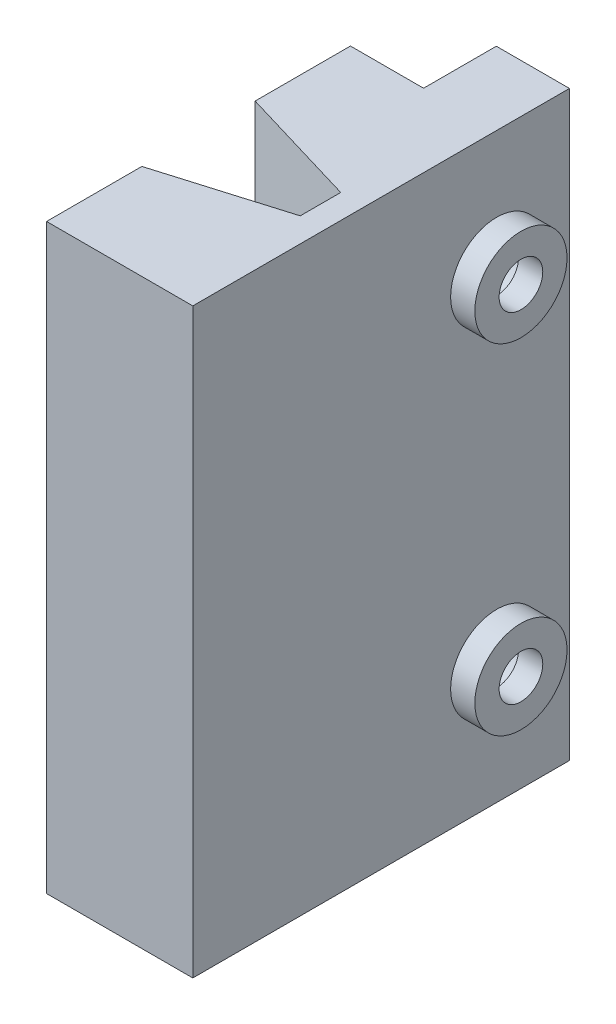
ISO-10303-21;
HEADER;
FILE_DESCRIPTION(('STEP AP214'),'2;1');
FILE_NAME('part.step','',(''),(''),'','','');
FILE_SCHEMA(('AUTOMOTIVE_DESIGN { 1 0 10303 214 1 1 1 1 }'));
ENDSEC;
DATA;
#1=APPLICATION_CONTEXT('core data for automotive mechanical design processes');
#2=APPLICATION_PROTOCOL_DEFINITION('international standard','automotive_design',2000,#1);
#3=PRODUCT_CONTEXT('',#1,'mechanical');
#4=PRODUCT('Part','Part','',(#3));
#5=PRODUCT_RELATED_PRODUCT_CATEGORY('part','',(#4));
#6=PRODUCT_DEFINITION_FORMATION('','',#4);
#7=PRODUCT_DEFINITION_CONTEXT('part definition',#1,'design');
#8=PRODUCT_DEFINITION('design','',#6,#7);
#9=PRODUCT_DEFINITION_SHAPE('','',#8);
#10=(LENGTH_UNIT() NAMED_UNIT(*) SI_UNIT(.MILLI.,.METRE.));
#11=(NAMED_UNIT(*) PLANE_ANGLE_UNIT() SI_UNIT($,.RADIAN.));
#12=(NAMED_UNIT(*) SI_UNIT($,.STERADIAN.) SOLID_ANGLE_UNIT());
#13=UNCERTAINTY_MEASURE_WITH_UNIT(LENGTH_MEASURE(1.E-05),#10,'distance_accuracy_value','');
#14=(GEOMETRIC_REPRESENTATION_CONTEXT(3) GLOBAL_UNCERTAINTY_ASSIGNED_CONTEXT((#13)) GLOBAL_UNIT_ASSIGNED_CONTEXT((#10,
#11,#12)) REPRESENTATION_CONTEXT('',''));
#15=CARTESIAN_POINT('',(0.,0.,0.));
#16=DIRECTION('',(0.,0.,1.));
#17=DIRECTION('',(1.,0.,0.));
#18=AXIS2_PLACEMENT_3D('',#15,#16,#17);
#19=CARTESIAN_POINT('',(-1.03,24.,1.785));
#20=DIRECTION('',(1.,0.,0.));
#21=DIRECTION('',(0.,0.,-1.));
#22=AXIS2_PLACEMENT_3D('',#19,#20,#21);
#23=PLANE('',#22);
#24=DIRECTION('',(0.,1.,0.));
#25=VECTOR('',#24,1.);
#26=CARTESIAN_POINT('',(-1.03,-6.,3.285));
#27=LINE('',#26,#25);
#28=CARTESIAN_POINT('',(-1.03,0.,3.285));
#29=VERTEX_POINT('',#28);
#30=CARTESIAN_POINT('',(-1.03,24.,3.285));
#31=VERTEX_POINT('',#30);
#32=EDGE_CURVE('E150',#29,#31,#27,.T.);
#33=ORIENTED_EDGE('',*,*,#32,.F.);
#34=DIRECTION('',(0.,0.,1.));
#35=VECTOR('',#34,1.);
#36=CARTESIAN_POINT('',(-1.03,0.,1.785));
#37=LINE('',#36,#35);
#38=CARTESIAN_POINT('',(-1.03,0.,7.215));
#39=VERTEX_POINT('',#38);
#40=EDGE_CURVE('E172',#29,#39,#37,.T.);
#41=ORIENTED_EDGE('',*,*,#40,.T.);
#42=DIRECTION('',(0.,-1.,0.));
#43=VECTOR('',#42,1.);
#44=CARTESIAN_POINT('',(-1.03,24.,7.215));
#45=LINE('',#44,#43);
#46=CARTESIAN_POINT('',(-1.03,24.,7.215));
#47=VERTEX_POINT('',#46);
#48=EDGE_CURVE('E155',#47,#39,#45,.T.);
#49=ORIENTED_EDGE('',*,*,#48,.F.);
#50=DIRECTION('',(0.,0.,1.));
#51=VECTOR('',#50,1.);
#52=CARTESIAN_POINT('',(-1.03,24.,1.785));
#53=LINE('',#52,#51);
#54=EDGE_CURVE('E153',#31,#47,#53,.T.);
#55=ORIENTED_EDGE('',*,*,#54,.F.);
#56=EDGE_LOOP('',(#33,#41,#49,#55));
#57=FACE_BOUND('',#56,.T.);
#58=ADVANCED_FACE('F32',(#57),#23,.F.);
#59=CARTESIAN_POINT('',(0.,24.,0.));
#60=DIRECTION('',(0.,1.,0.));
#61=DIRECTION('',(0.,0.,1.));
#62=AXIS2_PLACEMENT_3D('',#59,#60,#61);
#63=PLANE('',#62);
#64=DIRECTION('',(-0.958296914540683,0.,-0.285774427795432));
#65=VECTOR('',#64,1.);
#66=CARTESIAN_POINT('',(0.295174567799963,24.,-0.989818717355876));
#67=LINE('',#66,#65);
#68=CARTESIAN_POINT('',(4.,24.,0.115));
#69=VERTEX_POINT('',#68);
#70=CARTESIAN_POINT('',(-1.03,24.,-1.385));
#71=VERTEX_POINT('',#70);
#72=EDGE_CURVE('E133',#69,#71,#67,.T.);
#73=ORIENTED_EDGE('',*,*,#72,.F.);
#74=DIRECTION('',(0.,0.,1.));
#75=VECTOR('',#74,1.);
#76=CARTESIAN_POINT('',(4.,24.,0.115));
#77=LINE('',#76,#75);
#78=CARTESIAN_POINT('',(4.,24.,1.785));
#79=VERTEX_POINT('',#78);
#80=EDGE_CURVE('E146',#69,#79,#77,.T.);
#81=ORIENTED_EDGE('',*,*,#80,.T.);
#82=DIRECTION('',(-0.958296914540683,0.,0.285774427795432));
#83=VECTOR('',#82,1.);
#84=CARTESIAN_POINT('',(0.815502397380848,24.,2.73465137255044));
#85=LINE('',#84,#83);
#86=EDGE_CURVE('E206',#79,#31,#85,.T.);
#87=ORIENTED_EDGE('',*,*,#86,.T.);
#88=ORIENTED_EDGE('',*,*,#54,.T.);
#89=DIRECTION('',(1.,0.,0.));
#90=VECTOR('',#89,1.);
#91=CARTESIAN_POINT('',(5.,24.,7.215));
#92=LINE('',#91,#90);
#93=CARTESIAN_POINT('',(5.,24.,7.215));
#94=VERTEX_POINT('',#93);
#95=EDGE_CURVE('E176',#47,#94,#92,.T.);
#96=ORIENTED_EDGE('',*,*,#95,.T.);
#97=DIRECTION('',(0.,0.,-1.));
#98=VECTOR('',#97,1.);
#99=CARTESIAN_POINT('',(5.,24.,-5.315));
#100=LINE('',#99,#98);
#101=CARTESIAN_POINT('',(5.,24.,-8.315));
#102=VERTEX_POINT('',#101);
#103=EDGE_CURVE('E217',#94,#102,#100,.T.);
#104=ORIENTED_EDGE('',*,*,#103,.T.);
#105=DIRECTION('',(1.,0.,0.));
#106=VECTOR('',#105,1.);
#107=CARTESIAN_POINT('',(5.,24.,-8.315));
#108=LINE('',#107,#106);
#109=CARTESIAN_POINT('',(1.985,24.,-8.315));
#110=VERTEX_POINT('',#109);
#111=EDGE_CURVE('E286',#110,#102,#108,.T.);
#112=ORIENTED_EDGE('',*,*,#111,.F.);
#113=DIRECTION('',(0.,0.,1.));
#114=VECTOR('',#113,1.);
#115=CARTESIAN_POINT('',(1.985,24.,-8.315));
#116=LINE('',#115,#114);
#117=CARTESIAN_POINT('',(1.985,24.,-5.315));
#118=VERTEX_POINT('',#117);
#119=EDGE_CURVE('E227',#110,#118,#116,.T.);
#120=ORIENTED_EDGE('',*,*,#119,.T.);
#121=DIRECTION('',(-1.,0.,0.));
#122=VECTOR('',#121,1.);
#123=CARTESIAN_POINT('',(0.758759528759529,24.,-5.315));
#124=LINE('',#123,#122);
#125=CARTESIAN_POINT('',(-1.03,24.,-5.315));
#126=VERTEX_POINT('',#125);
#127=EDGE_CURVE('E157',#118,#126,#124,.T.);
#128=ORIENTED_EDGE('',*,*,#127,.T.);
#129=DIRECTION('',(0.,0.,1.));
#130=VECTOR('',#129,1.);
#131=CARTESIAN_POINT('',(-1.03,24.,-5.315));
#132=LINE('',#131,#130);
#133=EDGE_CURVE('E149',#126,#71,#132,.T.);
#134=ORIENTED_EDGE('',*,*,#133,.T.);
#135=EDGE_LOOP('',(#73,#81,#87,#88,#96,#104,#112,#120,#128,#134));
#136=FACE_BOUND('',#135,.T.);
#137=ADVANCED_FACE('F144',(#136),#63,.T.);
#138=CARTESIAN_POINT('',(0.,0.,0.));
#139=DIRECTION('',(0.,1.,0.));
#140=DIRECTION('',(0.,0.,1.));
#141=AXIS2_PLACEMENT_3D('',#138,#139,#140);
#142=PLANE('',#141);
#143=DIRECTION('',(0.,0.,1.));
#144=VECTOR('',#143,1.);
#145=CARTESIAN_POINT('',(4.,0.,0.115));
#146=LINE('',#145,#144);
#147=CARTESIAN_POINT('',(4.,0.,0.115));
#148=VERTEX_POINT('',#147);
#149=CARTESIAN_POINT('',(4.,0.,1.785));
#150=VERTEX_POINT('',#149);
#151=EDGE_CURVE('E170',#148,#150,#146,.T.);
#152=ORIENTED_EDGE('',*,*,#151,.F.);
#153=DIRECTION('',(-0.958296914540683,0.,-0.285774427795432));
#154=VECTOR('',#153,1.);
#155=CARTESIAN_POINT('',(0.295174567799963,0.,-0.989818717355876));
#156=LINE('',#155,#154);
#157=CARTESIAN_POINT('',(-1.03,0.,-1.385));
#158=VERTEX_POINT('',#157);
#159=EDGE_CURVE('E11',#148,#158,#156,.T.);
#160=ORIENTED_EDGE('',*,*,#159,.T.);
#161=DIRECTION('',(0.,0.,1.));
#162=VECTOR('',#161,1.);
#163=CARTESIAN_POINT('',(-1.03,0.,-5.315));
#164=LINE('',#163,#162);
#165=CARTESIAN_POINT('',(-1.03,0.,-5.315));
#166=VERTEX_POINT('',#165);
#167=EDGE_CURVE('E167',#166,#158,#164,.T.);
#168=ORIENTED_EDGE('',*,*,#167,.F.);
#169=DIRECTION('',(-1.,0.,0.));
#170=VECTOR('',#169,1.);
#171=CARTESIAN_POINT('',(-1.03,0.,-5.315));
#172=LINE('',#171,#170);
#173=CARTESIAN_POINT('',(1.985,0.,-5.315));
#174=VERTEX_POINT('',#173);
#175=EDGE_CURVE('E163',#174,#166,#172,.T.);
#176=ORIENTED_EDGE('',*,*,#175,.F.);
#177=DIRECTION('',(0.,0.,1.));
#178=VECTOR('',#177,1.);
#179=CARTESIAN_POINT('',(1.985,0.,-8.315));
#180=LINE('',#179,#178);
#181=CARTESIAN_POINT('',(1.985,0.,-8.315));
#182=VERTEX_POINT('',#181);
#183=EDGE_CURVE('E164',#182,#174,#180,.T.);
#184=ORIENTED_EDGE('',*,*,#183,.F.);
#185=DIRECTION('',(-1.,0.,0.));
#186=VECTOR('',#185,1.);
#187=CARTESIAN_POINT('',(5.,0.,-8.315));
#188=LINE('',#187,#186);
#189=CARTESIAN_POINT('',(5.,0.,-8.315));
#190=VERTEX_POINT('',#189);
#191=EDGE_CURVE('E281',#190,#182,#188,.T.);
#192=ORIENTED_EDGE('',*,*,#191,.F.);
#193=DIRECTION('',(0.,0.,-1.));
#194=VECTOR('',#193,1.);
#195=CARTESIAN_POINT('',(5.,0.,-5.315));
#196=LINE('',#195,#194);
#197=CARTESIAN_POINT('',(5.,0.,7.215));
#198=VERTEX_POINT('',#197);
#199=EDGE_CURVE('E161',#198,#190,#196,.T.);
#200=ORIENTED_EDGE('',*,*,#199,.F.);
#201=DIRECTION('',(1.,0.,0.));
#202=VECTOR('',#201,1.);
#203=CARTESIAN_POINT('',(-1.03,0.,7.215));
#204=LINE('',#203,#202);
#205=EDGE_CURVE('E174',#39,#198,#204,.T.);
#206=ORIENTED_EDGE('',*,*,#205,.F.);
#207=ORIENTED_EDGE('',*,*,#40,.F.);
#208=DIRECTION('',(-0.958296914540683,0.,0.285774427795432));
#209=VECTOR('',#208,1.);
#210=CARTESIAN_POINT('',(0.815502397380848,0.,2.73465137255044));
#211=LINE('',#210,#209);
#212=EDGE_CURVE('E40',#150,#29,#211,.T.);
#213=ORIENTED_EDGE('',*,*,#212,.F.);
#214=EDGE_LOOP('',(#152,#160,#168,#176,#184,#192,#200,#206,#207,#213));
#215=FACE_BOUND('',#214,.T.);
#216=ADVANCED_FACE('F209',(#215),#142,.F.);
#217=CARTESIAN_POINT('',(-1.03,24.,-5.315));
#218=DIRECTION('',(0.,0.,1.));
#219=DIRECTION('',(1.,0.,0.));
#220=AXIS2_PLACEMENT_3D('',#217,#218,#219);
#221=PLANE('',#220);
#222=DIRECTION('',(0.,-1.,0.));
#223=VECTOR('',#222,1.);
#224=CARTESIAN_POINT('',(-1.03,24.,-5.315));
#225=LINE('',#224,#223);
#226=CARTESIAN_POINT('',(-1.03,17.85,-5.315));
#227=VERTEX_POINT('',#226);
#228=CARTESIAN_POINT('',(-1.03,6.15,-5.315));
#229=VERTEX_POINT('',#228);
#230=EDGE_CURVE('E184',#227,#229,#225,.T.);
#231=ORIENTED_EDGE('',*,*,#230,.F.);
#232=DIRECTION('',(1.,0.,0.));
#233=VECTOR('',#232,1.);
#234=CARTESIAN_POINT('',(-18.,17.85,-5.315));
#235=LINE('',#234,#233);
#236=CARTESIAN_POINT('',(1.985,17.85,-5.315));
#237=VERTEX_POINT('',#236);
#238=EDGE_CURVE('E254',#227,#237,#235,.T.);
#239=ORIENTED_EDGE('',*,*,#238,.T.);
#240=DIRECTION('',(0.,1.,0.));
#241=VECTOR('',#240,1.);
#242=CARTESIAN_POINT('',(1.985,24.,-5.315));
#243=LINE('',#242,#241);
#244=CARTESIAN_POINT('',(1.985,6.15,-5.315));
#245=VERTEX_POINT('',#244);
#246=EDGE_CURVE('E290',#245,#237,#243,.T.);
#247=ORIENTED_EDGE('',*,*,#246,.F.);
#248=DIRECTION('',(1.,0.,0.));
#249=VECTOR('',#248,1.);
#250=CARTESIAN_POINT('',(-18.,6.15,-5.315));
#251=LINE('',#250,#249);
#252=EDGE_CURVE('E243',#245,#229,#251,.F.);
#253=ORIENTED_EDGE('',*,*,#252,.T.);
#254=EDGE_LOOP('',(#231,#239,#247,#253));
#255=FACE_BOUND('',#254,.T.);
#256=ADVANCED_FACE('F306',(#255),#221,.F.);
#257=CARTESIAN_POINT('',(-1.03,3.85,-5.315));
#258=VERTEX_POINT('',#257);
#259=EDGE_CURVE('E138',#258,#166,#225,.T.);
#260=ORIENTED_EDGE('',*,*,#259,.F.);
#261=DIRECTION('',(1.,0.,0.));
#262=VECTOR('',#261,1.);
#263=CARTESIAN_POINT('',(-18.,3.85,-5.315));
#264=LINE('',#263,#262);
#265=CARTESIAN_POINT('',(1.985,3.85,-5.315));
#266=VERTEX_POINT('',#265);
#267=EDGE_CURVE('E247',#258,#266,#264,.T.);
#268=ORIENTED_EDGE('',*,*,#267,.T.);
#269=EDGE_CURVE('E282',#174,#266,#243,.T.);
#270=ORIENTED_EDGE('',*,*,#269,.F.);
#271=ORIENTED_EDGE('',*,*,#175,.T.);
#272=EDGE_LOOP('',(#260,#268,#270,#271));
#273=FACE_BOUND('',#272,.T.);
#274=ADVANCED_FACE('F300',(#273),#221,.F.);
#275=CARTESIAN_POINT('',(1.985,20.15,-5.315));
#276=VERTEX_POINT('',#275);
#277=EDGE_CURVE('E277',#276,#118,#243,.T.);
#278=ORIENTED_EDGE('',*,*,#277,.F.);
#279=DIRECTION('',(1.,0.,0.));
#280=VECTOR('',#279,1.);
#281=CARTESIAN_POINT('',(-18.,20.15,-5.315));
#282=LINE('',#281,#280);
#283=CARTESIAN_POINT('',(-1.03,20.15,-5.315));
#284=VERTEX_POINT('',#283);
#285=EDGE_CURVE('E54',#276,#284,#282,.F.);
#286=ORIENTED_EDGE('',*,*,#285,.T.);
#287=EDGE_CURVE('E180',#126,#284,#225,.T.);
#288=ORIENTED_EDGE('',*,*,#287,.F.);
#289=ORIENTED_EDGE('',*,*,#127,.F.);
#290=EDGE_LOOP('',(#278,#286,#288,#289));
#291=FACE_BOUND('',#290,.T.);
#292=ADVANCED_FACE('F230',(#291),#221,.F.);
#293=CARTESIAN_POINT('',(5.,24.,-5.315));
#294=DIRECTION('',(-1.,0.,0.));
#295=DIRECTION('',(0.,0.,1.));
#296=AXIS2_PLACEMENT_3D('',#293,#294,#295);
#297=PLANE('',#296);
#298=CARTESIAN_POINT('',(5.,19.,-5.315));
#299=DIRECTION('',(-1.,0.,0.));
#300=DIRECTION('',(0.,0.,1.));
#301=AXIS2_PLACEMENT_3D('',#298,#299,#300);
#302=CIRCLE('',#301,1.9);
#303=CARTESIAN_POINT('',(5.,19.,-3.415));
#304=VERTEX_POINT('',#303);
#305=EDGE_CURVE('E190',#304,#304,#302,.F.);
#306=ORIENTED_EDGE('',*,*,#305,.F.);
#307=EDGE_LOOP('',(#306));
#308=FACE_BOUND('',#307,.T.);
#309=CARTESIAN_POINT('',(5.,5.,-5.315));
#310=DIRECTION('',(-1.,0.,0.));
#311=DIRECTION('',(0.,0.,1.));
#312=AXIS2_PLACEMENT_3D('',#309,#310,#311);
#313=CIRCLE('',#312,1.9);
#314=CARTESIAN_POINT('',(5.,5.,-3.415));
#315=VERTEX_POINT('',#314);
#316=EDGE_CURVE('E187',#315,#315,#313,.F.);
#317=ORIENTED_EDGE('',*,*,#316,.F.);
#318=EDGE_LOOP('',(#317));
#319=FACE_BOUND('',#318,.T.);
#320=ORIENTED_EDGE('',*,*,#199,.T.);
#321=DIRECTION('',(0.,-1.,0.));
#322=VECTOR('',#321,1.);
#323=CARTESIAN_POINT('',(5.,24.,-8.315));
#324=LINE('',#323,#322);
#325=EDGE_CURVE('E278',#102,#190,#324,.T.);
#326=ORIENTED_EDGE('',*,*,#325,.F.);
#327=ORIENTED_EDGE('',*,*,#103,.F.);
#328=DIRECTION('',(0.,-1.,0.));
#329=VECTOR('',#328,1.);
#330=CARTESIAN_POINT('',(5.,24.,7.215));
#331=LINE('',#330,#329);
#332=EDGE_CURVE('E183',#94,#198,#331,.T.);
#333=ORIENTED_EDGE('',*,*,#332,.T.);
#334=EDGE_LOOP('',(#320,#326,#327,#333));
#335=FACE_BOUND('',#334,.T.);
#336=ADVANCED_FACE('F34',(#308,#319,#335),#297,.F.);
#337=CARTESIAN_POINT('',(-1.03,24.,-5.315));
#338=DIRECTION('',(1.,0.,0.));
#339=DIRECTION('',(0.,0.,-1.));
#340=AXIS2_PLACEMENT_3D('',#337,#338,#339);
#341=PLANE('',#340);
#342=ORIENTED_EDGE('',*,*,#167,.T.);
#343=DIRECTION('',(0.,1.,0.));
#344=VECTOR('',#343,1.);
#345=CARTESIAN_POINT('',(-1.03,-6.,-1.385));
#346=LINE('',#345,#344);
#347=EDGE_CURVE('E47',#158,#71,#346,.T.);
#348=ORIENTED_EDGE('',*,*,#347,.T.);
#349=ORIENTED_EDGE('',*,*,#133,.F.);
#350=ORIENTED_EDGE('',*,*,#287,.T.);
#351=CARTESIAN_POINT('',(-1.03,19.,-5.315));
#352=DIRECTION('',(1.,0.,0.));
#353=DIRECTION('',(0.,0.,-1.));
#354=AXIS2_PLACEMENT_3D('',#351,#352,#353);
#355=CIRCLE('',#354,1.15);
#356=EDGE_CURVE('E257',#284,#227,#355,.T.);
#357=ORIENTED_EDGE('',*,*,#356,.T.);
#358=ORIENTED_EDGE('',*,*,#230,.T.);
#359=CARTESIAN_POINT('',(-1.03,5.,-5.315));
#360=DIRECTION('',(1.,0.,0.));
#361=DIRECTION('',(0.,0.,-1.));
#362=AXIS2_PLACEMENT_3D('',#359,#360,#361);
#363=CIRCLE('',#362,1.15);
#364=EDGE_CURVE('E250',#229,#258,#363,.T.);
#365=ORIENTED_EDGE('',*,*,#364,.T.);
#366=ORIENTED_EDGE('',*,*,#259,.T.);
#367=EDGE_LOOP('',(#342,#348,#349,#350,#357,#358,#365,#366));
#368=FACE_BOUND('',#367,.T.);
#369=ADVANCED_FACE('F233',(#368),#341,.F.);
#370=CARTESIAN_POINT('',(4.,24.,0.115));
#371=DIRECTION('',(1.,0.,0.));
#372=DIRECTION('',(0.,0.,-1.));
#373=AXIS2_PLACEMENT_3D('',#370,#371,#372);
#374=PLANE('',#373);
#375=ORIENTED_EDGE('',*,*,#151,.T.);
#376=DIRECTION('',(0.,-1.,0.));
#377=VECTOR('',#376,1.);
#378=CARTESIAN_POINT('',(4.,24.,1.785));
#379=LINE('',#378,#377);
#380=EDGE_CURVE('E139',#79,#150,#379,.T.);
#381=ORIENTED_EDGE('',*,*,#380,.F.);
#382=ORIENTED_EDGE('',*,*,#80,.F.);
#383=DIRECTION('',(0.,-1.,0.));
#384=VECTOR('',#383,1.);
#385=CARTESIAN_POINT('',(4.,24.,0.115));
#386=LINE('',#385,#384);
#387=EDGE_CURVE('E130',#69,#148,#386,.T.);
#388=ORIENTED_EDGE('',*,*,#387,.T.);
#389=EDGE_LOOP('',(#375,#381,#382,#388));
#390=FACE_BOUND('',#389,.T.);
#391=ADVANCED_FACE('F152',(#390),#374,.F.);
#392=CARTESIAN_POINT('',(-1.03,24.,7.215));
#393=DIRECTION('',(0.,0.,-1.));
#394=DIRECTION('',(-1.,0.,0.));
#395=AXIS2_PLACEMENT_3D('',#392,#393,#394);
#396=PLANE('',#395);
#397=ORIENTED_EDGE('',*,*,#205,.T.);
#398=ORIENTED_EDGE('',*,*,#332,.F.);
#399=ORIENTED_EDGE('',*,*,#95,.F.);
#400=ORIENTED_EDGE('',*,*,#48,.T.);
#401=EDGE_LOOP('',(#397,#398,#399,#400));
#402=FACE_BOUND('',#401,.T.);
#403=ADVANCED_FACE('F214',(#402),#396,.F.);
#404=CARTESIAN_POINT('',(1.985,24.,-8.315));
#405=DIRECTION('',(1.,0.,0.));
#406=DIRECTION('',(0.,0.,-1.));
#407=AXIS2_PLACEMENT_3D('',#404,#405,#406);
#408=PLANE('',#407);
#409=ORIENTED_EDGE('',*,*,#246,.T.);
#410=CARTESIAN_POINT('',(1.985,19.,-5.315));
#411=DIRECTION('',(1.,0.,0.));
#412=DIRECTION('',(0.,0.,-1.));
#413=AXIS2_PLACEMENT_3D('',#410,#411,#412);
#414=CIRCLE('',#413,1.15);
#415=EDGE_CURVE('E196',#237,#276,#414,.T.);
#416=ORIENTED_EDGE('',*,*,#415,.T.);
#417=ORIENTED_EDGE('',*,*,#277,.T.);
#418=ORIENTED_EDGE('',*,*,#119,.F.);
#419=DIRECTION('',(0.,1.,0.));
#420=VECTOR('',#419,1.);
#421=CARTESIAN_POINT('',(1.985,24.,-8.315));
#422=LINE('',#421,#420);
#423=EDGE_CURVE('E284',#182,#110,#422,.T.);
#424=ORIENTED_EDGE('',*,*,#423,.F.);
#425=ORIENTED_EDGE('',*,*,#183,.T.);
#426=ORIENTED_EDGE('',*,*,#269,.T.);
#427=CARTESIAN_POINT('',(1.985,5.,-5.315));
#428=DIRECTION('',(1.,0.,0.));
#429=DIRECTION('',(0.,0.,-1.));
#430=AXIS2_PLACEMENT_3D('',#427,#428,#429);
#431=CIRCLE('',#430,1.15);
#432=EDGE_CURVE('E193',#266,#245,#431,.T.);
#433=ORIENTED_EDGE('',*,*,#432,.T.);
#434=EDGE_LOOP('',(#409,#416,#417,#418,#424,#425,#426,#433));
#435=FACE_BOUND('',#434,.T.);
#436=ADVANCED_FACE('F296',(#435),#408,.F.);
#437=CARTESIAN_POINT('',(0.,0.,-8.315));
#438=DIRECTION('',(0.,0.,-1.));
#439=DIRECTION('',(-1.,0.,0.));
#440=AXIS2_PLACEMENT_3D('',#437,#438,#439);
#441=PLANE('',#440);
#442=ORIENTED_EDGE('',*,*,#325,.T.);
#443=ORIENTED_EDGE('',*,*,#191,.T.);
#444=ORIENTED_EDGE('',*,*,#423,.T.);
#445=ORIENTED_EDGE('',*,*,#111,.T.);
#446=EDGE_LOOP('',(#442,#443,#444,#445));
#447=FACE_BOUND('',#446,.T.);
#448=ADVANCED_FACE('F310',(#447),#441,.T.);
#449=CARTESIAN_POINT('',(6.,5.,-5.315));
#450=DIRECTION('',(1.,0.,0.));
#451=DIRECTION('',(0.,0.,-1.));
#452=AXIS2_PLACEMENT_3D('',#449,#450,#451);
#453=PLANE('',#452);
#454=CARTESIAN_POINT('',(6.,5.,-5.315));
#455=DIRECTION('',(1.,0.,0.));
#456=DIRECTION('',(0.,0.,-1.));
#457=AXIS2_PLACEMENT_3D('',#454,#455,#456);
#458=CIRCLE('',#457,1.9);
#459=CARTESIAN_POINT('',(6.,5.,-7.215));
#460=VERTEX_POINT('',#459);
#461=EDGE_CURVE('E272',#460,#460,#458,.T.);
#462=ORIENTED_EDGE('',*,*,#461,.T.);
#463=EDGE_LOOP('',(#462));
#464=FACE_BOUND('',#463,.T.);
#465=CARTESIAN_POINT('',(6.,5.,-5.315));
#466=DIRECTION('',(1.,0.,0.));
#467=DIRECTION('',(0.,0.,-1.));
#468=AXIS2_PLACEMENT_3D('',#465,#466,#467);
#469=CIRCLE('',#468,0.899999999999999);
#470=CARTESIAN_POINT('',(6.,5.,-6.215));
#471=VERTEX_POINT('',#470);
#472=EDGE_CURVE('E269',#471,#471,#469,.T.);
#473=ORIENTED_EDGE('',*,*,#472,.F.);
#474=EDGE_LOOP('',(#473));
#475=FACE_BOUND('',#474,.T.);
#476=ADVANCED_FACE('F341',(#464,#475),#453,.T.);
#477=CARTESIAN_POINT('',(6.,5.,-5.315));
#478=DIRECTION('',(-1.,0.,0.));
#479=DIRECTION('',(0.,0.,1.));
#480=AXIS2_PLACEMENT_3D('',#477,#478,#479);
#481=CYLINDRICAL_SURFACE('',#480,1.9);
#482=ORIENTED_EDGE('',*,*,#461,.F.);
#483=EDGE_LOOP('',(#482));
#484=FACE_BOUND('',#483,.T.);
#485=ORIENTED_EDGE('',*,*,#316,.T.);
#486=EDGE_LOOP('',(#485));
#487=FACE_BOUND('',#486,.T.);
#488=ADVANCED_FACE('F468',(#484,#487),#481,.T.);
#489=CARTESIAN_POINT('',(6.,5.,-5.315));
#490=DIRECTION('',(-1.,0.,0.));
#491=DIRECTION('',(0.,0.,1.));
#492=AXIS2_PLACEMENT_3D('',#489,#490,#491);
#493=CYLINDRICAL_SURFACE('',#492,0.899999999999999);
#494=ORIENTED_EDGE('',*,*,#472,.T.);
#495=EDGE_LOOP('',(#494));
#496=FACE_BOUND('',#495,.T.);
#497=CARTESIAN_POINT('',(5.,5.,-5.315));
#498=DIRECTION('',(1.,0.,0.));
#499=DIRECTION('',(0.,0.,-1.));
#500=AXIS2_PLACEMENT_3D('',#497,#498,#499);
#501=CIRCLE('',#500,0.899999999999999);
#502=CARTESIAN_POINT('',(5.,5.,-6.215));
#503=VERTEX_POINT('',#502);
#504=EDGE_CURVE('E264',#503,#503,#501,.T.);
#505=ORIENTED_EDGE('',*,*,#504,.F.);
#506=EDGE_LOOP('',(#505));
#507=FACE_BOUND('',#506,.T.);
#508=ADVANCED_FACE('F461',(#496,#507),#493,.F.);
#509=CARTESIAN_POINT('',(6.,19.,-5.315));
#510=DIRECTION('',(1.,0.,0.));
#511=DIRECTION('',(0.,0.,-1.));
#512=AXIS2_PLACEMENT_3D('',#509,#510,#511);
#513=PLANE('',#512);
#514=CARTESIAN_POINT('',(6.,19.,-5.315));
#515=DIRECTION('',(1.,0.,0.));
#516=DIRECTION('',(0.,0.,-1.));
#517=AXIS2_PLACEMENT_3D('',#514,#515,#516);
#518=CIRCLE('',#517,1.9);
#519=CARTESIAN_POINT('',(6.,19.,-7.215));
#520=VERTEX_POINT('',#519);
#521=EDGE_CURVE('E263',#520,#520,#518,.T.);
#522=ORIENTED_EDGE('',*,*,#521,.T.);
#523=EDGE_LOOP('',(#522));
#524=FACE_BOUND('',#523,.T.);
#525=CARTESIAN_POINT('',(6.,19.,-5.315));
#526=DIRECTION('',(1.,0.,0.));
#527=DIRECTION('',(0.,0.,-1.));
#528=AXIS2_PLACEMENT_3D('',#525,#526,#527);
#529=CIRCLE('',#528,0.900000000000001);
#530=CARTESIAN_POINT('',(6.,19.,-6.215));
#531=VERTEX_POINT('',#530);
#532=EDGE_CURVE('E260',#531,#531,#529,.T.);
#533=ORIENTED_EDGE('',*,*,#532,.F.);
#534=EDGE_LOOP('',(#533));
#535=FACE_BOUND('',#534,.T.);
#536=ADVANCED_FACE('F458',(#524,#535),#513,.T.);
#537=CARTESIAN_POINT('',(6.,19.,-5.315));
#538=DIRECTION('',(-1.,0.,0.));
#539=DIRECTION('',(0.,0.,1.));
#540=AXIS2_PLACEMENT_3D('',#537,#538,#539);
#541=CYLINDRICAL_SURFACE('',#540,1.9);
#542=ORIENTED_EDGE('',*,*,#521,.F.);
#543=EDGE_LOOP('',(#542));
#544=FACE_BOUND('',#543,.T.);
#545=ORIENTED_EDGE('',*,*,#305,.T.);
#546=EDGE_LOOP('',(#545));
#547=FACE_BOUND('',#546,.T.);
#548=ADVANCED_FACE('F456',(#544,#547),#541,.T.);
#549=CARTESIAN_POINT('',(6.,19.,-5.315));
#550=DIRECTION('',(-1.,0.,0.));
#551=DIRECTION('',(0.,0.,1.));
#552=AXIS2_PLACEMENT_3D('',#549,#550,#551);
#553=CYLINDRICAL_SURFACE('',#552,0.900000000000001);
#554=ORIENTED_EDGE('',*,*,#532,.T.);
#555=EDGE_LOOP('',(#554));
#556=FACE_BOUND('',#555,.T.);
#557=CARTESIAN_POINT('',(5.,19.,-5.315));
#558=DIRECTION('',(1.,0.,0.));
#559=DIRECTION('',(0.,0.,-1.));
#560=AXIS2_PLACEMENT_3D('',#557,#558,#559);
#561=CIRCLE('',#560,0.900000000000001);
#562=CARTESIAN_POINT('',(5.,19.,-6.215));
#563=VERTEX_POINT('',#562);
#564=EDGE_CURVE('E259',#563,#563,#561,.T.);
#565=ORIENTED_EDGE('',*,*,#564,.F.);
#566=EDGE_LOOP('',(#565));
#567=FACE_BOUND('',#566,.T.);
#568=ADVANCED_FACE('F374',(#556,#567),#553,.F.);
#569=CARTESIAN_POINT('',(-18.,5.,-5.315));
#570=DIRECTION('',(1.,0.,0.));
#571=DIRECTION('',(0.,0.,-1.));
#572=AXIS2_PLACEMENT_3D('',#569,#570,#571);
#573=CYLINDRICAL_SURFACE('',#572,1.15);
#574=CARTESIAN_POINT('',(5.,5.,-5.315));
#575=DIRECTION('',(1.,0.,0.));
#576=DIRECTION('',(0.,0.,-1.));
#577=AXIS2_PLACEMENT_3D('',#574,#575,#576);
#578=CIRCLE('',#577,1.15);
#579=CARTESIAN_POINT('',(5.,5.,-6.465));
#580=VERTEX_POINT('',#579);
#581=EDGE_CURVE('E235',#580,#580,#578,.T.);
#582=ORIENTED_EDGE('',*,*,#581,.T.);
#583=EDGE_LOOP('',(#582));
#584=FACE_BOUND('',#583,.T.);
#585=ORIENTED_EDGE('',*,*,#252,.F.);
#586=ORIENTED_EDGE('',*,*,#432,.F.);
#587=ORIENTED_EDGE('',*,*,#267,.F.);
#588=ORIENTED_EDGE('',*,*,#364,.F.);
#589=EDGE_LOOP('',(#585,#586,#587,#588));
#590=FACE_BOUND('',#589,.T.);
#591=ADVANCED_FACE('F302',(#584,#590),#573,.F.);
#592=CARTESIAN_POINT('',(5.,5.,-5.315));
#593=DIRECTION('',(1.,0.,0.));
#594=DIRECTION('',(0.,0.,-1.));
#595=AXIS2_PLACEMENT_3D('',#592,#593,#594);
#596=PLANE('',#595);
#597=ORIENTED_EDGE('',*,*,#504,.T.);
#598=EDGE_LOOP('',(#597));
#599=FACE_BOUND('',#598,.T.);
#600=ORIENTED_EDGE('',*,*,#581,.F.);
#601=EDGE_LOOP('',(#600));
#602=FACE_BOUND('',#601,.T.);
#603=ADVANCED_FACE('F373',(#599,#602),#596,.F.);
#604=CARTESIAN_POINT('',(-18.,19.,-5.315));
#605=DIRECTION('',(1.,0.,0.));
#606=DIRECTION('',(0.,0.,-1.));
#607=AXIS2_PLACEMENT_3D('',#604,#605,#606);
#608=CYLINDRICAL_SURFACE('',#607,1.15);
#609=CARTESIAN_POINT('',(5.,19.,-5.315));
#610=DIRECTION('',(1.,0.,0.));
#611=DIRECTION('',(0.,0.,-1.));
#612=AXIS2_PLACEMENT_3D('',#609,#610,#611);
#613=CIRCLE('',#612,1.15);
#614=CARTESIAN_POINT('',(5.,19.,-6.465));
#615=VERTEX_POINT('',#614);
#616=EDGE_CURVE('E238',#615,#615,#613,.T.);
#617=ORIENTED_EDGE('',*,*,#616,.T.);
#618=EDGE_LOOP('',(#617));
#619=FACE_BOUND('',#618,.T.);
#620=ORIENTED_EDGE('',*,*,#285,.F.);
#621=ORIENTED_EDGE('',*,*,#415,.F.);
#622=ORIENTED_EDGE('',*,*,#238,.F.);
#623=ORIENTED_EDGE('',*,*,#356,.F.);
#624=EDGE_LOOP('',(#620,#621,#622,#623));
#625=FACE_BOUND('',#624,.T.);
#626=ADVANCED_FACE('F386',(#619,#625),#608,.F.);
#627=CARTESIAN_POINT('',(5.,19.,-5.315));
#628=DIRECTION('',(1.,0.,0.));
#629=DIRECTION('',(0.,0.,-1.));
#630=AXIS2_PLACEMENT_3D('',#627,#628,#629);
#631=PLANE('',#630);
#632=ORIENTED_EDGE('',*,*,#564,.T.);
#633=EDGE_LOOP('',(#632));
#634=FACE_BOUND('',#633,.T.);
#635=ORIENTED_EDGE('',*,*,#616,.F.);
#636=EDGE_LOOP('',(#635));
#637=FACE_BOUND('',#636,.T.);
#638=ADVANCED_FACE('F396',(#634,#637),#631,.F.);
#639=CARTESIAN_POINT('',(0.815502397380848,-6.,2.73465137255044));
#640=DIRECTION('',(-0.285774427795432,0.,-0.958296914540683));
#641=DIRECTION('',(-0.958296914540683,0.,0.285774427795432));
#642=AXIS2_PLACEMENT_3D('',#639,#640,#641);
#643=PLANE('',#642);
#644=ORIENTED_EDGE('',*,*,#212,.T.);
#645=ORIENTED_EDGE('',*,*,#32,.T.);
#646=ORIENTED_EDGE('',*,*,#86,.F.);
#647=ORIENTED_EDGE('',*,*,#380,.T.);
#648=EDGE_LOOP('',(#644,#645,#646,#647));
#649=FACE_BOUND('',#648,.T.);
#650=ADVANCED_FACE('F200',(#649),#643,.T.);
#651=CARTESIAN_POINT('',(0.295174567799963,-6.,-0.989818717355876));
#652=DIRECTION('',(0.285774427795432,0.,-0.958296914540683));
#653=DIRECTION('',(-0.958296914540683,0.,-0.285774427795432));
#654=AXIS2_PLACEMENT_3D('',#651,#652,#653);
#655=PLANE('',#654);
#656=ORIENTED_EDGE('',*,*,#387,.F.);
#657=ORIENTED_EDGE('',*,*,#72,.T.);
#658=ORIENTED_EDGE('',*,*,#347,.F.);
#659=ORIENTED_EDGE('',*,*,#159,.F.);
#660=EDGE_LOOP('',(#656,#657,#658,#659));
#661=FACE_BOUND('',#660,.T.);
#662=ADVANCED_FACE('F132',(#661),#655,.F.);
#663=CLOSED_SHELL('',(#58,#137,#216,#256,#274,#292,#336,#369,#391,#403,#436,#448,#476,#488,#508,
#536,#548,#568,#591,#603,#626,#638,#650,#662));
#664=MANIFOLD_SOLID_BREP('B2',#663);
#665=ADVANCED_BREP_SHAPE_REPRESENTATION('',(#18,#664),#14);
#666=SHAPE_DEFINITION_REPRESENTATION(#9,#665);
ENDSEC;
END-ISO-10303-21;
